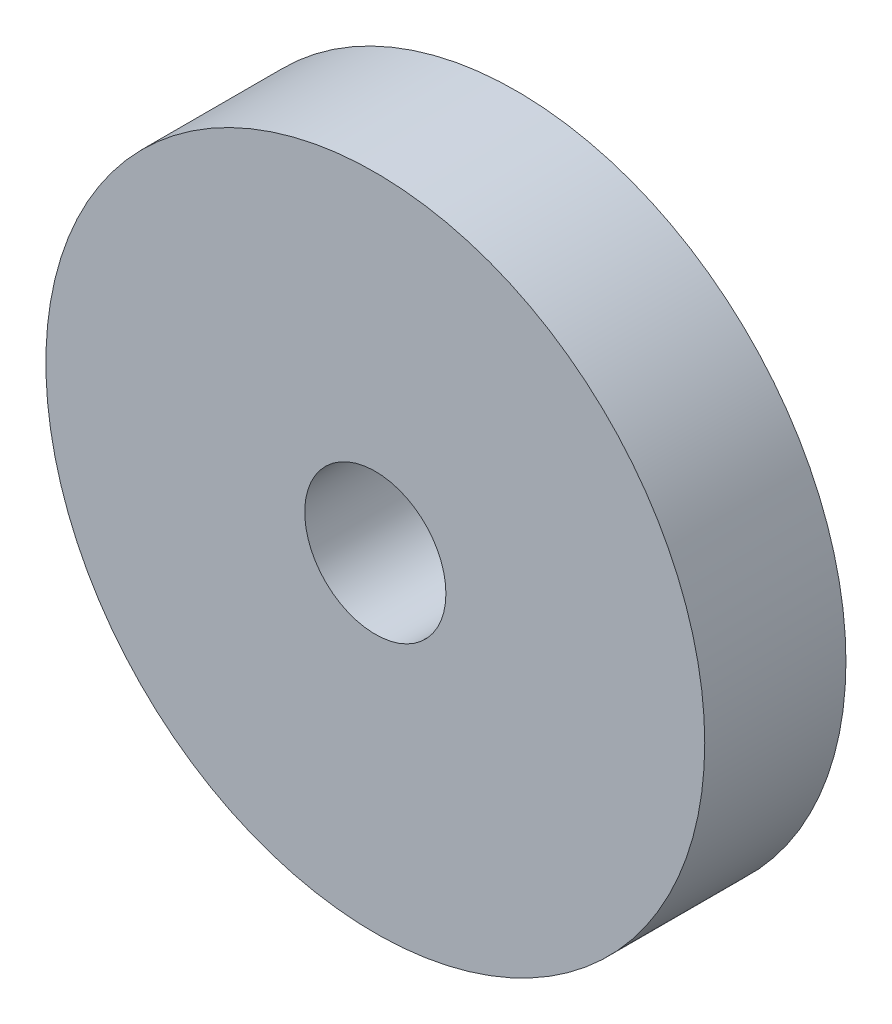
ISO-10303-21;
HEADER;
FILE_DESCRIPTION(('STEP AP214'),'2;1');
FILE_NAME('part.step','',(''),(''),'','','');
FILE_SCHEMA(('AUTOMOTIVE_DESIGN { 1 0 10303 214 1 1 1 1 }'));
ENDSEC;
DATA;
#1=APPLICATION_CONTEXT('core data for automotive mechanical design processes');
#2=APPLICATION_PROTOCOL_DEFINITION('international standard','automotive_design',2000,#1);
#3=PRODUCT_CONTEXT('',#1,'mechanical');
#4=PRODUCT('Part','Part','',(#3));
#5=PRODUCT_RELATED_PRODUCT_CATEGORY('part','',(#4));
#6=PRODUCT_DEFINITION_FORMATION('','',#4);
#7=PRODUCT_DEFINITION_CONTEXT('part definition',#1,'design');
#8=PRODUCT_DEFINITION('design','',#6,#7);
#9=PRODUCT_DEFINITION_SHAPE('','',#8);
#10=(LENGTH_UNIT() NAMED_UNIT(*) SI_UNIT(.MILLI.,.METRE.));
#11=(NAMED_UNIT(*) PLANE_ANGLE_UNIT() SI_UNIT($,.RADIAN.));
#12=(NAMED_UNIT(*) SI_UNIT($,.STERADIAN.) SOLID_ANGLE_UNIT());
#13=UNCERTAINTY_MEASURE_WITH_UNIT(LENGTH_MEASURE(1.E-05),#10,'distance_accuracy_value','');
#14=(GEOMETRIC_REPRESENTATION_CONTEXT(3) GLOBAL_UNCERTAINTY_ASSIGNED_CONTEXT((#13)) GLOBAL_UNIT_ASSIGNED_CONTEXT((#10,
#11,#12)) REPRESENTATION_CONTEXT('',''));
#15=CARTESIAN_POINT('',(0.,0.,0.));
#16=DIRECTION('',(0.,0.,1.));
#17=DIRECTION('',(1.,0.,0.));
#18=AXIS2_PLACEMENT_3D('',#15,#16,#17);
#19=CARTESIAN_POINT('',(0.,0.,3.));
#20=DIRECTION('',(0.,0.,-1.));
#21=DIRECTION('',(-1.,0.,0.));
#22=AXIS2_PLACEMENT_3D('',#19,#20,#21);
#23=CYLINDRICAL_SURFACE('',#22,7.);
#24=CARTESIAN_POINT('',(0.,0.,3.));
#25=DIRECTION('',(0.,0.,1.));
#26=DIRECTION('',(1.,0.,0.));
#27=AXIS2_PLACEMENT_3D('',#24,#25,#26);
#28=CIRCLE('',#27,7.);
#29=CARTESIAN_POINT('',(7.,0.,3.));
#30=VERTEX_POINT('',#29);
#31=EDGE_CURVE('E10',#30,#30,#28,.T.);
#32=ORIENTED_EDGE('',*,*,#31,.F.);
#33=EDGE_LOOP('',(#32));
#34=FACE_BOUND('',#33,.T.);
#35=CARTESIAN_POINT('',(0.,0.,0.));
#36=DIRECTION('',(0.,0.,1.));
#37=DIRECTION('',(1.,0.,0.));
#38=AXIS2_PLACEMENT_3D('',#35,#36,#37);
#39=CIRCLE('',#38,7.);
#40=CARTESIAN_POINT('',(7.,0.,0.));
#41=VERTEX_POINT('',#40);
#42=EDGE_CURVE('E44',#41,#41,#39,.T.);
#43=ORIENTED_EDGE('',*,*,#42,.T.);
#44=EDGE_LOOP('',(#43));
#45=FACE_BOUND('',#44,.T.);
#46=ADVANCED_FACE('F41',(#34,#45),#23,.T.);
#47=CARTESIAN_POINT('',(0.,0.,3.));
#48=DIRECTION('',(0.,0.,1.));
#49=DIRECTION('',(1.,0.,0.));
#50=AXIS2_PLACEMENT_3D('',#47,#48,#49);
#51=PLANE('',#50);
#52=CARTESIAN_POINT('',(0.,0.,3.));
#53=DIRECTION('',(0.,0.,1.));
#54=DIRECTION('',(1.,0.,0.));
#55=AXIS2_PLACEMENT_3D('',#52,#53,#54);
#56=CIRCLE('',#55,1.5);
#57=CARTESIAN_POINT('',(1.5,0.,3.));
#58=VERTEX_POINT('',#57);
#59=EDGE_CURVE('E58',#58,#58,#56,.T.);
#60=ORIENTED_EDGE('',*,*,#59,.F.);
#61=EDGE_LOOP('',(#60));
#62=FACE_BOUND('',#61,.T.);
#63=ORIENTED_EDGE('',*,*,#31,.T.);
#64=EDGE_LOOP('',(#63));
#65=FACE_BOUND('',#64,.T.);
#66=ADVANCED_FACE('F65',(#62,#65),#51,.T.);
#67=CARTESIAN_POINT('',(0.,0.,0.));
#68=DIRECTION('',(0.,0.,1.));
#69=DIRECTION('',(1.,0.,0.));
#70=AXIS2_PLACEMENT_3D('',#67,#68,#69);
#71=PLANE('',#70);
#72=CARTESIAN_POINT('',(0.,0.,0.));
#73=DIRECTION('',(0.,0.,1.));
#74=DIRECTION('',(1.,0.,0.));
#75=AXIS2_PLACEMENT_3D('',#72,#73,#74);
#76=CIRCLE('',#75,1.5);
#77=CARTESIAN_POINT('',(1.5,0.,0.));
#78=VERTEX_POINT('',#77);
#79=EDGE_CURVE('E53',#78,#78,#76,.F.);
#80=ORIENTED_EDGE('',*,*,#79,.F.);
#81=EDGE_LOOP('',(#80));
#82=FACE_BOUND('',#81,.T.);
#83=ORIENTED_EDGE('',*,*,#42,.F.);
#84=EDGE_LOOP('',(#83));
#85=FACE_BOUND('',#84,.T.);
#86=ADVANCED_FACE('F67',(#82,#85),#71,.F.);
#87=CARTESIAN_POINT('',(0.,0.,-4.24264068711929));
#88=DIRECTION('',(0.,0.,1.));
#89=DIRECTION('',(1.,0.,0.));
#90=AXIS2_PLACEMENT_3D('',#87,#88,#89);
#91=CYLINDRICAL_SURFACE('',#90,1.5);
#92=ORIENTED_EDGE('',*,*,#79,.T.);
#93=EDGE_LOOP('',(#92));
#94=FACE_BOUND('',#93,.T.);
#95=ORIENTED_EDGE('',*,*,#59,.T.);
#96=EDGE_LOOP('',(#95));
#97=FACE_BOUND('',#96,.T.);
#98=ADVANCED_FACE('F63',(#94,#97),#91,.F.);
#99=CLOSED_SHELL('',(#46,#66,#86,#98));
#100=MANIFOLD_SOLID_BREP('B2',#99);
#101=ADVANCED_BREP_SHAPE_REPRESENTATION('',(#18,#100),#14);
#102=SHAPE_DEFINITION_REPRESENTATION(#9,#101);
ENDSEC;
END-ISO-10303-21;
